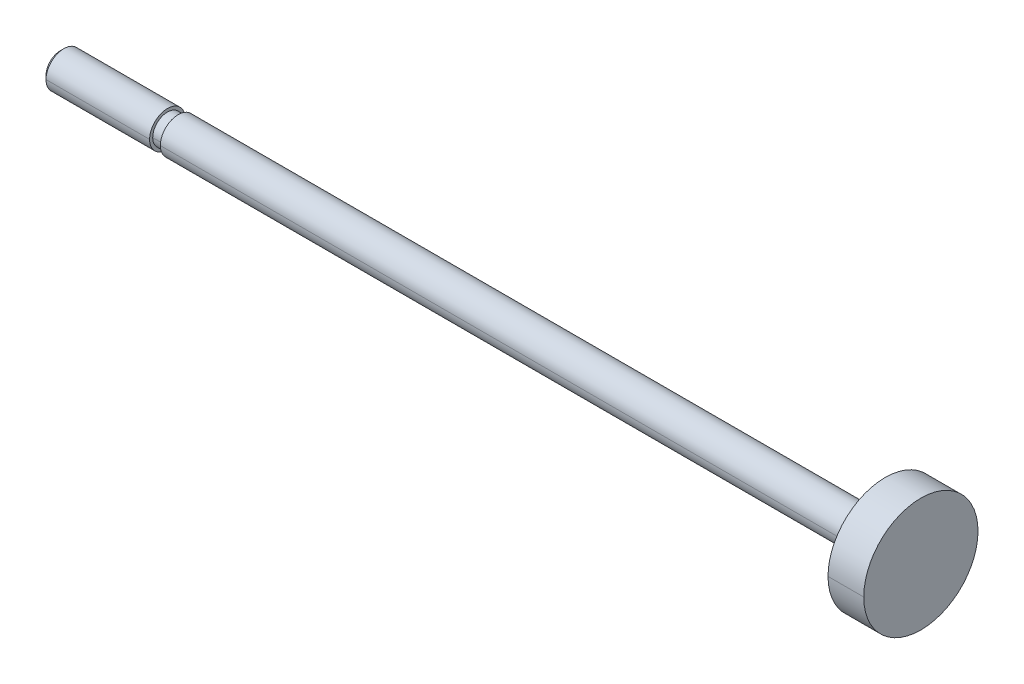
ISO-10303-21;
HEADER;
FILE_DESCRIPTION(('STEP AP214'),'2;1');
FILE_NAME('part.step','',(''),(''),'','','');
FILE_SCHEMA(('AUTOMOTIVE_DESIGN { 1 0 10303 214 1 1 1 1 }'));
ENDSEC;
DATA;
#1=APPLICATION_CONTEXT('core data for automotive mechanical design processes');
#2=APPLICATION_PROTOCOL_DEFINITION('international standard','automotive_design',2000,#1);
#3=PRODUCT_CONTEXT('',#1,'mechanical');
#4=PRODUCT('Part','Part','',(#3));
#5=PRODUCT_RELATED_PRODUCT_CATEGORY('part','',(#4));
#6=PRODUCT_DEFINITION_FORMATION('','',#4);
#7=PRODUCT_DEFINITION_CONTEXT('part definition',#1,'design');
#8=PRODUCT_DEFINITION('design','',#6,#7);
#9=PRODUCT_DEFINITION_SHAPE('','',#8);
#10=(LENGTH_UNIT() NAMED_UNIT(*) SI_UNIT(.MILLI.,.METRE.));
#11=(NAMED_UNIT(*) PLANE_ANGLE_UNIT() SI_UNIT($,.RADIAN.));
#12=(NAMED_UNIT(*) SI_UNIT($,.STERADIAN.) SOLID_ANGLE_UNIT());
#13=UNCERTAINTY_MEASURE_WITH_UNIT(LENGTH_MEASURE(1.E-05),#10,'distance_accuracy_value','');
#14=(GEOMETRIC_REPRESENTATION_CONTEXT(3) GLOBAL_UNCERTAINTY_ASSIGNED_CONTEXT((#13)) GLOBAL_UNIT_ASSIGNED_CONTEXT((#10,
#11,#12)) REPRESENTATION_CONTEXT('',''));
#15=CARTESIAN_POINT('',(0.,0.,0.));
#16=DIRECTION('',(0.,0.,1.));
#17=DIRECTION('',(1.,0.,0.));
#18=AXIS2_PLACEMENT_3D('',#15,#16,#17);
#19=CARTESIAN_POINT('',(120.5,0.,0.));
#20=DIRECTION('',(-1.,0.,0.));
#21=DIRECTION('',(0.,-1.,0.));
#22=AXIS2_PLACEMENT_3D('',#19,#20,#21);
#23=CYLINDRICAL_SURFACE('',#22,8.);
#24=CARTESIAN_POINT('',(120.5,0.,0.));
#25=DIRECTION('',(1.,0.,0.));
#26=DIRECTION('',(0.,0.,-1.));
#27=AXIS2_PLACEMENT_3D('',#24,#25,#26);
#28=CIRCLE('',#27,8.);
#29=CARTESIAN_POINT('',(120.5,0.,-8.));
#30=VERTEX_POINT('',#29);
#31=CARTESIAN_POINT('',(120.5,0.,8.));
#32=VERTEX_POINT('',#31);
#33=EDGE_CURVE('E11',#30,#32,#28,.T.);
#34=ORIENTED_EDGE('',*,*,#33,.F.);
#35=DIRECTION('',(-1.,0.,0.));
#36=VECTOR('',#35,1.);
#37=CARTESIAN_POINT('',(120.5,0.,-8.));
#38=LINE('',#37,#36);
#39=CARTESIAN_POINT('',(115.5,0.,-8.));
#40=VERTEX_POINT('',#39);
#41=EDGE_CURVE('E25',#30,#40,#38,.T.);
#42=ORIENTED_EDGE('',*,*,#41,.T.);
#43=CARTESIAN_POINT('',(115.5,0.,0.));
#44=DIRECTION('',(1.,0.,0.));
#45=DIRECTION('',(0.,0.,-1.));
#46=AXIS2_PLACEMENT_3D('',#43,#44,#45);
#47=CIRCLE('',#46,8.);
#48=CARTESIAN_POINT('',(115.5,0.,8.));
#49=VERTEX_POINT('',#48);
#50=EDGE_CURVE('E201',#40,#49,#47,.T.);
#51=ORIENTED_EDGE('',*,*,#50,.T.);
#52=DIRECTION('',(-1.,0.,0.));
#53=VECTOR('',#52,1.);
#54=CARTESIAN_POINT('',(120.5,0.,8.));
#55=LINE('',#54,#53);
#56=EDGE_CURVE('E196',#32,#49,#55,.T.);
#57=ORIENTED_EDGE('',*,*,#56,.F.);
#58=EDGE_LOOP('',(#34,#42,#51,#57));
#59=FACE_BOUND('',#58,.T.);
#60=ADVANCED_FACE('F17',(#59),#23,.T.);
#61=CARTESIAN_POINT('',(120.5,0.,0.));
#62=DIRECTION('',(-1.,0.,0.));
#63=DIRECTION('',(0.,1.,0.));
#64=AXIS2_PLACEMENT_3D('',#61,#62,#63);
#65=CYLINDRICAL_SURFACE('',#64,8.);
#66=CARTESIAN_POINT('',(115.5,0.,0.));
#67=DIRECTION('',(1.,0.,0.));
#68=DIRECTION('',(0.,0.,-1.));
#69=AXIS2_PLACEMENT_3D('',#66,#67,#68);
#70=CIRCLE('',#69,8.);
#71=EDGE_CURVE('E192',#49,#40,#70,.T.);
#72=ORIENTED_EDGE('',*,*,#71,.T.);
#73=ORIENTED_EDGE('',*,*,#41,.F.);
#74=CARTESIAN_POINT('',(120.5,0.,0.));
#75=DIRECTION('',(1.,0.,0.));
#76=DIRECTION('',(0.,0.,-1.));
#77=AXIS2_PLACEMENT_3D('',#74,#75,#76);
#78=CIRCLE('',#77,8.);
#79=EDGE_CURVE('E187',#32,#30,#78,.T.);
#80=ORIENTED_EDGE('',*,*,#79,.F.);
#81=ORIENTED_EDGE('',*,*,#56,.T.);
#82=EDGE_LOOP('',(#72,#73,#80,#81));
#83=FACE_BOUND('',#82,.T.);
#84=ADVANCED_FACE('F214',(#83),#65,.T.);
#85=CARTESIAN_POINT('',(120.5,8.,0.));
#86=DIRECTION('',(-1.,0.,0.));
#87=DIRECTION('',(0.,0.,1.));
#88=AXIS2_PLACEMENT_3D('',#85,#86,#87);
#89=PLANE('',#88);
#90=ORIENTED_EDGE('',*,*,#33,.T.);
#91=ORIENTED_EDGE('',*,*,#79,.T.);
#92=EDGE_LOOP('',(#90,#91));
#93=FACE_BOUND('',#92,.T.);
#94=ADVANCED_FACE('F219',(#93),#89,.F.);
#95=CARTESIAN_POINT('',(115.5,2.5,0.));
#96=DIRECTION('',(1.,0.,0.));
#97=DIRECTION('',(0.,0.,-1.));
#98=AXIS2_PLACEMENT_3D('',#95,#96,#97);
#99=PLANE('',#98);
#100=ORIENTED_EDGE('',*,*,#50,.F.);
#101=ORIENTED_EDGE('',*,*,#71,.F.);
#102=EDGE_LOOP('',(#100,#101));
#103=FACE_BOUND('',#102,.T.);
#104=CARTESIAN_POINT('',(115.5,0.,0.));
#105=DIRECTION('',(1.,0.,0.));
#106=DIRECTION('',(0.,0.,-1.));
#107=AXIS2_PLACEMENT_3D('',#104,#105,#106);
#108=CIRCLE('',#107,2.5);
#109=CARTESIAN_POINT('',(115.5,0.,-2.5));
#110=VERTEX_POINT('',#109);
#111=CARTESIAN_POINT('',(115.5,0.,2.5));
#112=VERTEX_POINT('',#111);
#113=EDGE_CURVE('E183',#110,#112,#108,.T.);
#114=ORIENTED_EDGE('',*,*,#113,.T.);
#115=CARTESIAN_POINT('',(115.5,0.,0.));
#116=DIRECTION('',(1.,0.,0.));
#117=DIRECTION('',(0.,0.,-1.));
#118=AXIS2_PLACEMENT_3D('',#115,#116,#117);
#119=CIRCLE('',#118,2.5);
#120=EDGE_CURVE('E179',#112,#110,#119,.T.);
#121=ORIENTED_EDGE('',*,*,#120,.T.);
#122=EDGE_LOOP('',(#114,#121));
#123=FACE_BOUND('',#122,.T.);
#124=ADVANCED_FACE('F215',(#103,#123),#99,.F.);
#125=CARTESIAN_POINT('',(120.5,0.,0.));
#126=DIRECTION('',(-1.,0.,0.));
#127=DIRECTION('',(0.,1.,0.));
#128=AXIS2_PLACEMENT_3D('',#125,#126,#127);
#129=CYLINDRICAL_SURFACE('',#128,2.5);
#130=CARTESIAN_POINT('',(16.5,0.,0.));
#131=DIRECTION('',(1.,0.,0.));
#132=DIRECTION('',(0.,0.,-1.));
#133=AXIS2_PLACEMENT_3D('',#130,#131,#132);
#134=CIRCLE('',#133,2.5);
#135=CARTESIAN_POINT('',(16.5,0.,2.5));
#136=VERTEX_POINT('',#135);
#137=CARTESIAN_POINT('',(16.5,0.,-2.5));
#138=VERTEX_POINT('',#137);
#139=EDGE_CURVE('E175',#136,#138,#134,.T.);
#140=ORIENTED_EDGE('',*,*,#139,.T.);
#141=DIRECTION('',(-1.,0.,0.));
#142=VECTOR('',#141,1.);
#143=CARTESIAN_POINT('',(115.5,0.,-2.5));
#144=LINE('',#143,#142);
#145=EDGE_CURVE('E170',#110,#138,#144,.T.);
#146=ORIENTED_EDGE('',*,*,#145,.F.);
#147=ORIENTED_EDGE('',*,*,#120,.F.);
#148=DIRECTION('',(-1.,0.,0.));
#149=VECTOR('',#148,1.);
#150=CARTESIAN_POINT('',(115.5,0.,2.5));
#151=LINE('',#150,#149);
#152=EDGE_CURVE('E166',#112,#136,#151,.T.);
#153=ORIENTED_EDGE('',*,*,#152,.T.);
#154=EDGE_LOOP('',(#140,#146,#147,#153));
#155=FACE_BOUND('',#154,.T.);
#156=ADVANCED_FACE('F218',(#155),#129,.T.);
#157=CARTESIAN_POINT('',(120.5,0.,0.));
#158=DIRECTION('',(-1.,0.,0.));
#159=DIRECTION('',(0.,-1.,0.));
#160=AXIS2_PLACEMENT_3D('',#157,#158,#159);
#161=CYLINDRICAL_SURFACE('',#160,2.5);
#162=ORIENTED_EDGE('',*,*,#113,.F.);
#163=ORIENTED_EDGE('',*,*,#145,.T.);
#164=CARTESIAN_POINT('',(16.5,0.,0.));
#165=DIRECTION('',(1.,0.,0.));
#166=DIRECTION('',(0.,0.,-1.));
#167=AXIS2_PLACEMENT_3D('',#164,#165,#166);
#168=CIRCLE('',#167,2.5);
#169=EDGE_CURVE('E161',#138,#136,#168,.T.);
#170=ORIENTED_EDGE('',*,*,#169,.T.);
#171=ORIENTED_EDGE('',*,*,#152,.F.);
#172=EDGE_LOOP('',(#162,#163,#170,#171));
#173=FACE_BOUND('',#172,.T.);
#174=ADVANCED_FACE('F227',(#173),#161,.T.);
#175=CARTESIAN_POINT('',(16.5,2.067,0.));
#176=DIRECTION('',(1.,0.,0.));
#177=DIRECTION('',(0.,0.,-1.));
#178=AXIS2_PLACEMENT_3D('',#175,#176,#177);
#179=PLANE('',#178);
#180=ORIENTED_EDGE('',*,*,#169,.F.);
#181=ORIENTED_EDGE('',*,*,#139,.F.);
#182=EDGE_LOOP('',(#180,#181));
#183=FACE_BOUND('',#182,.T.);
#184=CARTESIAN_POINT('',(16.5,0.,0.));
#185=DIRECTION('',(1.,0.,0.));
#186=DIRECTION('',(0.,0.,-1.));
#187=AXIS2_PLACEMENT_3D('',#184,#185,#186);
#188=CIRCLE('',#187,2.067);
#189=CARTESIAN_POINT('',(16.5,0.,-2.067));
#190=VERTEX_POINT('',#189);
#191=CARTESIAN_POINT('',(16.5,0.,2.067));
#192=VERTEX_POINT('',#191);
#193=EDGE_CURVE('E157',#190,#192,#188,.T.);
#194=ORIENTED_EDGE('',*,*,#193,.T.);
#195=CARTESIAN_POINT('',(16.5,0.,0.));
#196=DIRECTION('',(1.,0.,0.));
#197=DIRECTION('',(0.,0.,-1.));
#198=AXIS2_PLACEMENT_3D('',#195,#196,#197);
#199=CIRCLE('',#198,2.067);
#200=EDGE_CURVE('E153',#192,#190,#199,.T.);
#201=ORIENTED_EDGE('',*,*,#200,.T.);
#202=EDGE_LOOP('',(#194,#201));
#203=FACE_BOUND('',#202,.T.);
#204=ADVANCED_FACE('F231',(#183,#203),#179,.F.);
#205=CARTESIAN_POINT('',(120.5,0.,0.));
#206=DIRECTION('',(-1.,0.,0.));
#207=DIRECTION('',(0.,1.,0.));
#208=AXIS2_PLACEMENT_3D('',#205,#206,#207);
#209=CYLINDRICAL_SURFACE('',#208,2.067);
#210=CARTESIAN_POINT('',(15.,0.,0.));
#211=DIRECTION('',(1.,0.,0.));
#212=DIRECTION('',(0.,0.,-1.));
#213=AXIS2_PLACEMENT_3D('',#210,#211,#212);
#214=CIRCLE('',#213,2.067);
#215=CARTESIAN_POINT('',(15.,0.,2.067));
#216=VERTEX_POINT('',#215);
#217=CARTESIAN_POINT('',(15.,0.,-2.067));
#218=VERTEX_POINT('',#217);
#219=EDGE_CURVE('E149',#216,#218,#214,.T.);
#220=ORIENTED_EDGE('',*,*,#219,.T.);
#221=DIRECTION('',(-1.,0.,0.));
#222=VECTOR('',#221,1.);
#223=CARTESIAN_POINT('',(16.5,0.,-2.067));
#224=LINE('',#223,#222);
#225=EDGE_CURVE('E144',#190,#218,#224,.T.);
#226=ORIENTED_EDGE('',*,*,#225,.F.);
#227=ORIENTED_EDGE('',*,*,#200,.F.);
#228=DIRECTION('',(-1.,0.,0.));
#229=VECTOR('',#228,1.);
#230=CARTESIAN_POINT('',(16.5,0.,2.067));
#231=LINE('',#230,#229);
#232=EDGE_CURVE('E140',#192,#216,#231,.T.);
#233=ORIENTED_EDGE('',*,*,#232,.T.);
#234=EDGE_LOOP('',(#220,#226,#227,#233));
#235=FACE_BOUND('',#234,.T.);
#236=ADVANCED_FACE('F234',(#235),#209,.T.);
#237=CARTESIAN_POINT('',(120.5,0.,0.));
#238=DIRECTION('',(-1.,0.,0.));
#239=DIRECTION('',(0.,-1.,0.));
#240=AXIS2_PLACEMENT_3D('',#237,#238,#239);
#241=CYLINDRICAL_SURFACE('',#240,2.067);
#242=ORIENTED_EDGE('',*,*,#193,.F.);
#243=ORIENTED_EDGE('',*,*,#225,.T.);
#244=CARTESIAN_POINT('',(15.,0.,0.));
#245=DIRECTION('',(1.,0.,0.));
#246=DIRECTION('',(0.,0.,-1.));
#247=AXIS2_PLACEMENT_3D('',#244,#245,#246);
#248=CIRCLE('',#247,2.067);
#249=EDGE_CURVE('E135',#218,#216,#248,.T.);
#250=ORIENTED_EDGE('',*,*,#249,.T.);
#251=ORIENTED_EDGE('',*,*,#232,.F.);
#252=EDGE_LOOP('',(#242,#243,#250,#251));
#253=FACE_BOUND('',#252,.T.);
#254=ADVANCED_FACE('F242',(#253),#241,.T.);
#255=CARTESIAN_POINT('',(15.,2.5,0.));
#256=DIRECTION('',(-1.,0.,0.));
#257=DIRECTION('',(0.,0.,1.));
#258=AXIS2_PLACEMENT_3D('',#255,#256,#257);
#259=PLANE('',#258);
#260=ORIENTED_EDGE('',*,*,#249,.F.);
#261=ORIENTED_EDGE('',*,*,#219,.F.);
#262=EDGE_LOOP('',(#260,#261));
#263=FACE_BOUND('',#262,.T.);
#264=CARTESIAN_POINT('',(15.,0.,0.));
#265=DIRECTION('',(1.,0.,0.));
#266=DIRECTION('',(0.,0.,-1.));
#267=AXIS2_PLACEMENT_3D('',#264,#265,#266);
#268=CIRCLE('',#267,2.5);
#269=CARTESIAN_POINT('',(15.,0.,-2.5));
#270=VERTEX_POINT('',#269);
#271=CARTESIAN_POINT('',(15.,0.,2.5));
#272=VERTEX_POINT('',#271);
#273=EDGE_CURVE('E131',#270,#272,#268,.T.);
#274=ORIENTED_EDGE('',*,*,#273,.T.);
#275=CARTESIAN_POINT('',(15.,0.,0.));
#276=DIRECTION('',(1.,0.,0.));
#277=DIRECTION('',(0.,0.,-1.));
#278=AXIS2_PLACEMENT_3D('',#275,#276,#277);
#279=CIRCLE('',#278,2.5);
#280=EDGE_CURVE('E127',#272,#270,#279,.T.);
#281=ORIENTED_EDGE('',*,*,#280,.T.);
#282=EDGE_LOOP('',(#274,#281));
#283=FACE_BOUND('',#282,.T.);
#284=ADVANCED_FACE('F246',(#263,#283),#259,.F.);
#285=CARTESIAN_POINT('',(120.5,0.,0.));
#286=DIRECTION('',(-1.,0.,0.));
#287=DIRECTION('',(0.,1.,0.));
#288=AXIS2_PLACEMENT_3D('',#285,#286,#287);
#289=CYLINDRICAL_SURFACE('',#288,2.5);
#290=CARTESIAN_POINT('',(0.490500000000005,0.,0.));
#291=DIRECTION('',(1.,0.,0.));
#292=DIRECTION('',(0.,0.,-1.));
#293=AXIS2_PLACEMENT_3D('',#290,#291,#292);
#294=CIRCLE('',#293,2.5);
#295=CARTESIAN_POINT('',(0.490500000000011,0.,2.5));
#296=VERTEX_POINT('',#295);
#297=CARTESIAN_POINT('',(0.490500000000005,0.,-2.5));
#298=VERTEX_POINT('',#297);
#299=EDGE_CURVE('E98',#296,#298,#294,.T.);
#300=ORIENTED_EDGE('',*,*,#299,.T.);
#301=DIRECTION('',(-1.,0.,0.));
#302=VECTOR('',#301,1.);
#303=CARTESIAN_POINT('',(15.,0.,-2.5));
#304=LINE('',#303,#302);
#305=EDGE_CURVE('E119',#270,#298,#304,.T.);
#306=ORIENTED_EDGE('',*,*,#305,.F.);
#307=ORIENTED_EDGE('',*,*,#280,.F.);
#308=DIRECTION('',(-1.,0.,0.));
#309=VECTOR('',#308,1.);
#310=CARTESIAN_POINT('',(15.,0.,2.5));
#311=LINE('',#310,#309);
#312=EDGE_CURVE('E115',#272,#296,#311,.T.);
#313=ORIENTED_EDGE('',*,*,#312,.T.);
#314=EDGE_LOOP('',(#300,#306,#307,#313));
#315=FACE_BOUND('',#314,.T.);
#316=ADVANCED_FACE('F249',(#315),#289,.T.);
#317=CARTESIAN_POINT('',(120.5,0.,0.));
#318=DIRECTION('',(-1.,0.,0.));
#319=DIRECTION('',(0.,-1.,0.));
#320=AXIS2_PLACEMENT_3D('',#317,#318,#319);
#321=CYLINDRICAL_SURFACE('',#320,2.5);
#322=ORIENTED_EDGE('',*,*,#273,.F.);
#323=ORIENTED_EDGE('',*,*,#305,.T.);
#324=CARTESIAN_POINT('',(0.490500000000005,0.,0.));
#325=DIRECTION('',(1.,0.,0.));
#326=DIRECTION('',(0.,0.,-1.));
#327=AXIS2_PLACEMENT_3D('',#324,#325,#326);
#328=CIRCLE('',#327,2.5);
#329=EDGE_CURVE('E110',#298,#296,#328,.T.);
#330=ORIENTED_EDGE('',*,*,#329,.T.);
#331=ORIENTED_EDGE('',*,*,#312,.F.);
#332=EDGE_LOOP('',(#322,#323,#330,#331));
#333=FACE_BOUND('',#332,.T.);
#334=ADVANCED_FACE('F257',(#333),#321,.T.);
#335=CARTESIAN_POINT('',(0.,0.,0.));
#336=DIRECTION('',(1.,0.,0.));
#337=DIRECTION('',(0.,-1.,0.));
#338=AXIS2_PLACEMENT_3D('',#335,#336,#337);
#339=CONICAL_SURFACE('',#338,2.0095,0.7853981634);
#340=ORIENTED_EDGE('',*,*,#329,.F.);
#341=DIRECTION('',(0.707106781184743,0.,-0.707106781188352));
#342=VECTOR('',#341,1.);
#343=CARTESIAN_POINT('',(0.,0.,-2.0095));
#344=LINE('',#343,#342);
#345=CARTESIAN_POINT('',(0.,0.,-2.0095));
#346=VERTEX_POINT('',#345);
#347=EDGE_CURVE('E90',#346,#298,#344,.T.);
#348=ORIENTED_EDGE('',*,*,#347,.F.);
#349=CARTESIAN_POINT('',(0.,0.,0.));
#350=DIRECTION('',(1.,0.,0.));
#351=DIRECTION('',(0.,0.,-1.));
#352=AXIS2_PLACEMENT_3D('',#349,#350,#351);
#353=CIRCLE('',#352,2.0095);
#354=CARTESIAN_POINT('',(0.,0.,2.0095));
#355=VERTEX_POINT('',#354);
#356=EDGE_CURVE('E83',#346,#355,#353,.T.);
#357=ORIENTED_EDGE('',*,*,#356,.T.);
#358=DIRECTION('',(0.707106781184743,0.,0.707106781188352));
#359=VECTOR('',#358,1.);
#360=CARTESIAN_POINT('',(0.,0.,2.0095));
#361=LINE('',#360,#359);
#362=EDGE_CURVE('E87',#355,#296,#361,.T.);
#363=ORIENTED_EDGE('',*,*,#362,.T.);
#364=EDGE_LOOP('',(#340,#348,#357,#363));
#365=FACE_BOUND('',#364,.T.);
#366=ADVANCED_FACE('F86',(#365),#339,.T.);
#367=CARTESIAN_POINT('',(0.,0.,0.));
#368=DIRECTION('',(1.,0.,0.));
#369=DIRECTION('',(0.,1.,0.));
#370=AXIS2_PLACEMENT_3D('',#367,#368,#369);
#371=CONICAL_SURFACE('',#370,2.0095,0.7853981634);
#372=CARTESIAN_POINT('',(0.,0.,0.));
#373=DIRECTION('',(1.,0.,0.));
#374=DIRECTION('',(0.,0.,-1.));
#375=AXIS2_PLACEMENT_3D('',#372,#373,#374);
#376=CIRCLE('',#375,2.0095);
#377=EDGE_CURVE('E97',#355,#346,#376,.T.);
#378=ORIENTED_EDGE('',*,*,#377,.T.);
#379=ORIENTED_EDGE('',*,*,#347,.T.);
#380=ORIENTED_EDGE('',*,*,#299,.F.);
#381=ORIENTED_EDGE('',*,*,#362,.F.);
#382=EDGE_LOOP('',(#378,#379,#380,#381));
#383=FACE_BOUND('',#382,.T.);
#384=ADVANCED_FACE('F96',(#383),#371,.T.);
#385=CARTESIAN_POINT('',(0.,0.,0.));
#386=DIRECTION('',(1.,0.,0.));
#387=DIRECTION('',(0.,0.,-1.));
#388=AXIS2_PLACEMENT_3D('',#385,#386,#387);
#389=PLANE('',#388);
#390=ORIENTED_EDGE('',*,*,#356,.F.);
#391=ORIENTED_EDGE('',*,*,#377,.F.);
#392=EDGE_LOOP('',(#390,#391));
#393=FACE_BOUND('',#392,.T.);
#394=ADVANCED_FACE('F100',(#393),#389,.F.);
#395=CLOSED_SHELL('',(#60,#84,#94,#124,#156,#174,#204,#236,#254,#284,#316,#334,#366,#384,#394));
#396=MANIFOLD_SOLID_BREP('B1',#395);
#397=ADVANCED_BREP_SHAPE_REPRESENTATION('',(#18,#396),#14);
#398=SHAPE_DEFINITION_REPRESENTATION(#9,#397);
ENDSEC;
END-ISO-10303-21;
